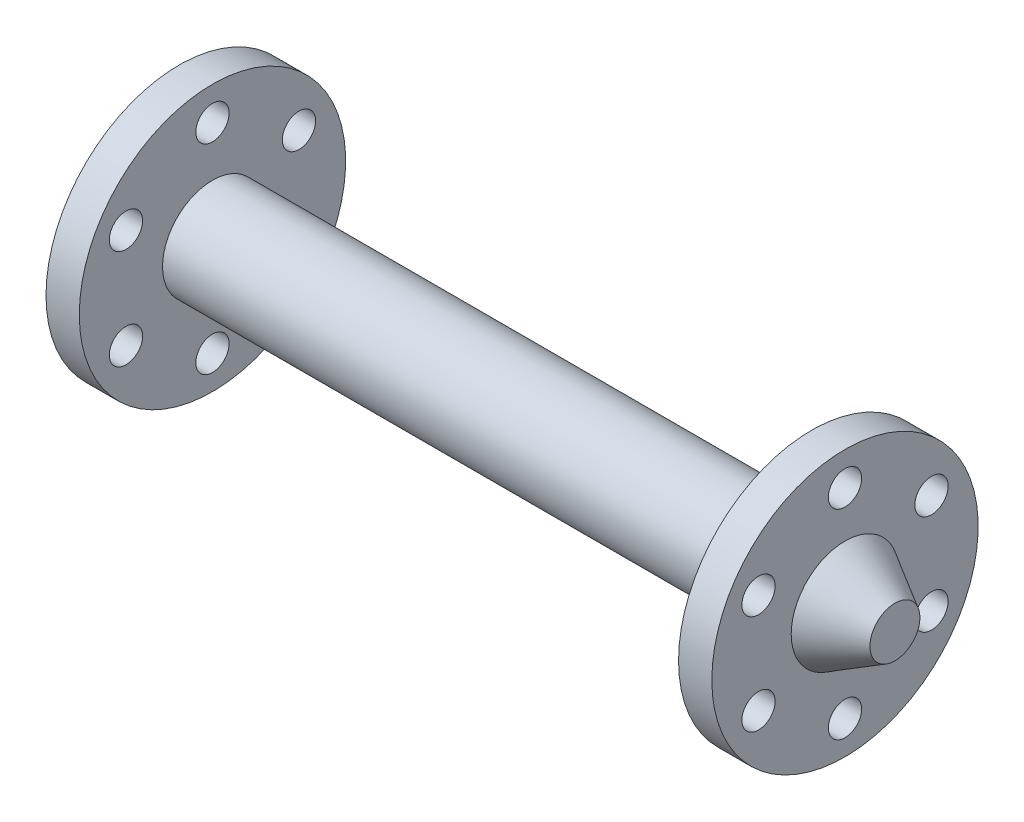
ISO-10303-21;
HEADER;
FILE_DESCRIPTION(('STEP AP214'),'2;1');
FILE_NAME('part.step','',(''),(''),'','','');
FILE_SCHEMA(('AUTOMOTIVE_DESIGN { 1 0 10303 214 1 1 1 1 }'));
ENDSEC;
DATA;
#1=APPLICATION_CONTEXT('core data for automotive mechanical design processes');
#2=APPLICATION_PROTOCOL_DEFINITION('international standard','automotive_design',2000,#1);
#3=PRODUCT_CONTEXT('',#1,'mechanical');
#4=PRODUCT('Part','Part','',(#3));
#5=PRODUCT_RELATED_PRODUCT_CATEGORY('part','',(#4));
#6=PRODUCT_DEFINITION_FORMATION('','',#4);
#7=PRODUCT_DEFINITION_CONTEXT('part definition',#1,'design');
#8=PRODUCT_DEFINITION('design','',#6,#7);
#9=PRODUCT_DEFINITION_SHAPE('','',#8);
#10=(LENGTH_UNIT() NAMED_UNIT(*) SI_UNIT(.MILLI.,.METRE.));
#11=(NAMED_UNIT(*) PLANE_ANGLE_UNIT() SI_UNIT($,.RADIAN.));
#12=(NAMED_UNIT(*) SI_UNIT($,.STERADIAN.) SOLID_ANGLE_UNIT());
#13=UNCERTAINTY_MEASURE_WITH_UNIT(LENGTH_MEASURE(1.E-05),#10,'distance_accuracy_value','');
#14=(GEOMETRIC_REPRESENTATION_CONTEXT(3) GLOBAL_UNCERTAINTY_ASSIGNED_CONTEXT((#13)) GLOBAL_UNIT_ASSIGNED_CONTEXT((#10,
#11,#12)) REPRESENTATION_CONTEXT('',''));
#15=CARTESIAN_POINT('',(0.,0.,0.));
#16=DIRECTION('',(0.,0.,1.));
#17=DIRECTION('',(1.,0.,0.));
#18=AXIS2_PLACEMENT_3D('',#15,#16,#17);
#19=CARTESIAN_POINT('',(-40.,0.,0.));
#20=DIRECTION('',(1.,0.,0.));
#21=DIRECTION('',(0.,0.,-1.));
#22=AXIS2_PLACEMENT_3D('',#19,#20,#21);
#23=PLANE('',#22);
#24=CARTESIAN_POINT('',(-39.9999999999999,0.,0.));
#25=DIRECTION('',(-1.,0.,0.));
#26=DIRECTION('',(0.,0.,1.));
#27=AXIS2_PLACEMENT_3D('',#24,#25,#26);
#28=CIRCLE('',#27,15.);
#29=CARTESIAN_POINT('',(-39.9999999999999,0.,15.));
#30=VERTEX_POINT('',#29);
#31=EDGE_CURVE('E123',#30,#30,#28,.T.);
#32=ORIENTED_EDGE('',*,*,#31,.T.);
#33=EDGE_LOOP('',(#32));
#34=FACE_BOUND('',#33,.T.);
#35=ADVANCED_FACE('F42',(#34),#23,.F.);
#36=CARTESIAN_POINT('',(420.,0.,-3.10862446895044E-12));
#37=DIRECTION('',(1.,0.,0.));
#38=DIRECTION('',(0.,0.,-1.));
#39=AXIS2_PLACEMENT_3D('',#36,#37,#38);
#40=PLANE('',#39);
#41=CARTESIAN_POINT('',(420.,0.,-1.70349845340922E-12));
#42=DIRECTION('',(-1.,0.,0.));
#43=DIRECTION('',(0.,0.,1.));
#44=AXIS2_PLACEMENT_3D('',#41,#42,#43);
#45=CIRCLE('',#44,15.);
#46=CARTESIAN_POINT('',(420.,0.,14.9999999999983));
#47=VERTEX_POINT('',#46);
#48=EDGE_CURVE('E10',#47,#47,#45,.T.);
#49=ORIENTED_EDGE('',*,*,#48,.F.);
#50=EDGE_LOOP('',(#49));
#51=FACE_BOUND('',#50,.T.);
#52=ADVANCED_FACE('F170',(#51),#40,.T.);
#53=CARTESIAN_POINT('',(420.,0.,-1.70349845340922E-12));
#54=DIRECTION('',(-1.,0.,0.));
#55=DIRECTION('',(0.,0.,1.));
#56=AXIS2_PLACEMENT_3D('',#53,#54,#55);
#57=CONICAL_SURFACE('',#56,15.,0.523598775598295);
#58=CARTESIAN_POINT('',(390.,0.,-1.59240072818688E-12));
#59=DIRECTION('',(-1.,0.,0.));
#60=DIRECTION('',(0.,0.,1.));
#61=AXIS2_PLACEMENT_3D('',#58,#59,#60);
#62=CIRCLE('',#61,32.3205080756886);
#63=CARTESIAN_POINT('',(390.,0.,32.3205080756871));
#64=VERTEX_POINT('',#63);
#65=EDGE_CURVE('E50',#64,#64,#62,.T.);
#66=ORIENTED_EDGE('',*,*,#65,.F.);
#67=EDGE_LOOP('',(#66));
#68=FACE_BOUND('',#67,.T.);
#69=ORIENTED_EDGE('',*,*,#48,.T.);
#70=EDGE_LOOP('',(#69));
#71=FACE_BOUND('',#70,.T.);
#72=ADVANCED_FACE('F158',(#68,#71),#57,.T.);
#73=CARTESIAN_POINT('',(390.,0.,-2.84147705365001E-12));
#74=DIRECTION('',(1.,0.,0.));
#75=DIRECTION('',(0.,0.,-1.));
#76=AXIS2_PLACEMENT_3D('',#73,#74,#75);
#77=PLANE('',#76);
#78=CARTESIAN_POINT('',(390.,60.,-1.44427042789043E-12));
#79=DIRECTION('',(1.,0.,0.));
#80=DIRECTION('',(0.,0.,-1.));
#81=AXIS2_PLACEMENT_3D('',#78,#79,#80);
#82=CIRCLE('',#81,10.);
#83=CARTESIAN_POINT('',(390.,60.,-10.0000000000014));
#84=VERTEX_POINT('',#83);
#85=EDGE_CURVE('E119',#84,#84,#82,.T.);
#86=ORIENTED_EDGE('',*,*,#85,.F.);
#87=EDGE_LOOP('',(#86));
#88=FACE_BOUND('',#87,.T.);
#89=CARTESIAN_POINT('',(390.,30.0000000000006,-51.9615242270674));
#90=DIRECTION('',(1.,0.,0.));
#91=DIRECTION('',(0.,0.,-1.));
#92=AXIS2_PLACEMENT_3D('',#89,#90,#91);
#93=CIRCLE('',#92,10.);
#94=CARTESIAN_POINT('',(390.,30.0000000000006,-61.9615242270674));
#95=VERTEX_POINT('',#94);
#96=EDGE_CURVE('E107',#95,#95,#93,.T.);
#97=ORIENTED_EDGE('',*,*,#96,.F.);
#98=EDGE_LOOP('',(#97));
#99=FACE_BOUND('',#98,.T.);
#100=CARTESIAN_POINT('',(390.,-29.9999999999995,-51.9615242270681));
#101=DIRECTION('',(1.,0.,0.));
#102=DIRECTION('',(0.,0.,-1.));
#103=AXIS2_PLACEMENT_3D('',#100,#101,#102);
#104=CIRCLE('',#103,9.99999999999999);
#105=CARTESIAN_POINT('',(390.,-29.9999999999995,-61.961524227068));
#106=VERTEX_POINT('',#105);
#107=EDGE_CURVE('E86',#106,#106,#104,.T.);
#108=ORIENTED_EDGE('',*,*,#107,.F.);
#109=EDGE_LOOP('',(#108));
#110=FACE_BOUND('',#109,.T.);
#111=CARTESIAN_POINT('',(390.,-60.,-1.8632481885516E-12));
#112=DIRECTION('',(1.,0.,0.));
#113=DIRECTION('',(0.,0.,-1.));
#114=AXIS2_PLACEMENT_3D('',#111,#112,#113);
#115=CIRCLE('',#114,10.);
#116=CARTESIAN_POINT('',(390.,-60.,-10.0000000000019));
#117=VERTEX_POINT('',#116);
#118=EDGE_CURVE('E81',#117,#117,#115,.T.);
#119=ORIENTED_EDGE('',*,*,#118,.F.);
#120=EDGE_LOOP('',(#119));
#121=FACE_BOUND('',#120,.T.);
#122=CARTESIAN_POINT('',(390.,-30.0000000000002,51.9615242270647));
#123=DIRECTION('',(1.,0.,0.));
#124=DIRECTION('',(0.,0.,-1.));
#125=AXIS2_PLACEMENT_3D('',#122,#123,#124);
#126=CIRCLE('',#125,10.);
#127=CARTESIAN_POINT('',(390.,-30.0000000000002,41.9615242270647));
#128=VERTEX_POINT('',#127);
#129=EDGE_CURVE('E76',#128,#128,#126,.T.);
#130=ORIENTED_EDGE('',*,*,#129,.F.);
#131=EDGE_LOOP('',(#130));
#132=FACE_BOUND('',#131,.T.);
#133=CARTESIAN_POINT('',(390.,29.9999999999999,51.9615242270649));
#134=DIRECTION('',(1.,0.,0.));
#135=DIRECTION('',(0.,0.,-1.));
#136=AXIS2_PLACEMENT_3D('',#133,#134,#135);
#137=CIRCLE('',#136,10.);
#138=CARTESIAN_POINT('',(390.,29.9999999999999,41.9615242270649));
#139=VERTEX_POINT('',#138);
#140=EDGE_CURVE('E70',#139,#139,#137,.T.);
#141=ORIENTED_EDGE('',*,*,#140,.F.);
#142=EDGE_LOOP('',(#141));
#143=FACE_BOUND('',#142,.T.);
#144=ORIENTED_EDGE('',*,*,#65,.T.);
#145=EDGE_LOOP('',(#144));
#146=FACE_BOUND('',#145,.T.);
#147=CARTESIAN_POINT('',(390.,0.,-1.59240072818688E-12));
#148=DIRECTION('',(-1.,0.,0.));
#149=DIRECTION('',(0.,0.,1.));
#150=AXIS2_PLACEMENT_3D('',#147,#148,#149);
#151=CIRCLE('',#150,79.9999999999999);
#152=CARTESIAN_POINT('',(390.,0.,79.9999999999983));
#153=VERTEX_POINT('',#152);
#154=EDGE_CURVE('E56',#153,#153,#151,.T.);
#155=ORIENTED_EDGE('',*,*,#154,.F.);
#156=EDGE_LOOP('',(#155));
#157=FACE_BOUND('',#156,.T.);
#158=ADVANCED_FACE('F156',(#88,#99,#110,#121,#132,#143,#146,#157),#77,.T.);
#159=CARTESIAN_POINT('',(-40.,0.,0.));
#160=DIRECTION('',(-1.,0.,0.));
#161=DIRECTION('',(0.,0.,1.));
#162=AXIS2_PLACEMENT_3D('',#159,#160,#161);
#163=CYLINDRICAL_SURFACE('',#162,79.9999999999998);
#164=CARTESIAN_POINT('',(370.,0.,-1.51833557803866E-12));
#165=DIRECTION('',(-1.,0.,0.));
#166=DIRECTION('',(0.,0.,1.));
#167=AXIS2_PLACEMENT_3D('',#164,#165,#166);
#168=CIRCLE('',#167,79.9999999999998);
#169=CARTESIAN_POINT('',(370.,0.,79.9999999999983));
#170=VERTEX_POINT('',#169);
#171=EDGE_CURVE('E147',#170,#170,#168,.T.);
#172=ORIENTED_EDGE('',*,*,#171,.F.);
#173=EDGE_LOOP('',(#172));
#174=FACE_BOUND('',#173,.T.);
#175=ORIENTED_EDGE('',*,*,#154,.T.);
#176=EDGE_LOOP('',(#175));
#177=FACE_BOUND('',#176,.T.);
#178=ADVANCED_FACE('F154',(#174,#177),#163,.T.);
#179=CARTESIAN_POINT('',(370.,0.,0.));
#180=DIRECTION('',(1.,0.,0.));
#181=DIRECTION('',(0.,0.,-1.));
#182=AXIS2_PLACEMENT_3D('',#179,#180,#181);
#183=PLANE('',#182);
#184=CARTESIAN_POINT('',(370.,60.,-1.3702052777422E-12));
#185=DIRECTION('',(1.,0.,0.));
#186=DIRECTION('',(0.,0.,-1.));
#187=AXIS2_PLACEMENT_3D('',#184,#185,#186);
#188=CIRCLE('',#187,10.);
#189=CARTESIAN_POINT('',(370.,60.,-10.0000000000014));
#190=VERTEX_POINT('',#189);
#191=EDGE_CURVE('E115',#190,#190,#188,.T.);
#192=ORIENTED_EDGE('',*,*,#191,.T.);
#193=EDGE_LOOP('',(#192));
#194=FACE_BOUND('',#193,.T.);
#195=CARTESIAN_POINT('',(370.,30.0000000000006,-51.9615242270673));
#196=DIRECTION('',(1.,0.,0.));
#197=DIRECTION('',(0.,0.,-1.));
#198=AXIS2_PLACEMENT_3D('',#195,#196,#197);
#199=CIRCLE('',#198,10.);
#200=CARTESIAN_POINT('',(370.,30.0000000000006,-61.9615242270673));
#201=VERTEX_POINT('',#200);
#202=EDGE_CURVE('E92',#201,#201,#199,.T.);
#203=ORIENTED_EDGE('',*,*,#202,.T.);
#204=EDGE_LOOP('',(#203));
#205=FACE_BOUND('',#204,.T.);
#206=CARTESIAN_POINT('',(370.,-29.9999999999995,-51.961524227068));
#207=DIRECTION('',(1.,0.,0.));
#208=DIRECTION('',(0.,0.,-1.));
#209=AXIS2_PLACEMENT_3D('',#206,#207,#208);
#210=CIRCLE('',#209,9.99999999999999);
#211=CARTESIAN_POINT('',(370.,-29.9999999999995,-61.961524227068));
#212=VERTEX_POINT('',#211);
#213=EDGE_CURVE('E95',#212,#212,#210,.T.);
#214=ORIENTED_EDGE('',*,*,#213,.T.);
#215=EDGE_LOOP('',(#214));
#216=FACE_BOUND('',#215,.T.);
#217=CARTESIAN_POINT('',(370.,-60.,-1.78918303840338E-12));
#218=DIRECTION('',(1.,0.,0.));
#219=DIRECTION('',(0.,0.,-1.));
#220=AXIS2_PLACEMENT_3D('',#217,#218,#219);
#221=CIRCLE('',#220,10.);
#222=CARTESIAN_POINT('',(370.,-60.,-10.0000000000018));
#223=VERTEX_POINT('',#222);
#224=EDGE_CURVE('E227',#223,#223,#221,.T.);
#225=ORIENTED_EDGE('',*,*,#224,.T.);
#226=EDGE_LOOP('',(#225));
#227=FACE_BOUND('',#226,.T.);
#228=CARTESIAN_POINT('',(370.,-30.0000000000002,51.9615242270648));
#229=DIRECTION('',(1.,0.,0.));
#230=DIRECTION('',(0.,0.,-1.));
#231=AXIS2_PLACEMENT_3D('',#228,#229,#230);
#232=CIRCLE('',#231,10.);
#233=CARTESIAN_POINT('',(370.,-30.0000000000002,41.9615242270648));
#234=VERTEX_POINT('',#233);
#235=EDGE_CURVE('E231',#234,#234,#232,.T.);
#236=ORIENTED_EDGE('',*,*,#235,.T.);
#237=EDGE_LOOP('',(#236));
#238=FACE_BOUND('',#237,.T.);
#239=CARTESIAN_POINT('',(370.,29.9999999999999,51.961524227065));
#240=DIRECTION('',(1.,0.,0.));
#241=DIRECTION('',(0.,0.,-1.));
#242=AXIS2_PLACEMENT_3D('',#239,#240,#241);
#243=CIRCLE('',#242,10.);
#244=CARTESIAN_POINT('',(370.,29.9999999999999,41.961524227065));
#245=VERTEX_POINT('',#244);
#246=EDGE_CURVE('E235',#245,#245,#243,.T.);
#247=ORIENTED_EDGE('',*,*,#246,.T.);
#248=EDGE_LOOP('',(#247));
#249=FACE_BOUND('',#248,.T.);
#250=CARTESIAN_POINT('',(370.,0.,-1.51833557803866E-12));
#251=DIRECTION('',(-1.,0.,0.));
#252=DIRECTION('',(0.,0.,1.));
#253=AXIS2_PLACEMENT_3D('',#250,#251,#252);
#254=CIRCLE('',#253,29.9999999999985);
#255=CARTESIAN_POINT('',(370.,0.,29.999999999997));
#256=VERTEX_POINT('',#255);
#257=EDGE_CURVE('E143',#256,#256,#254,.T.);
#258=ORIENTED_EDGE('',*,*,#257,.F.);
#259=EDGE_LOOP('',(#258));
#260=FACE_BOUND('',#259,.T.);
#261=ORIENTED_EDGE('',*,*,#171,.T.);
#262=EDGE_LOOP('',(#261));
#263=FACE_BOUND('',#262,.T.);
#264=ADVANCED_FACE('F166',(#194,#205,#216,#227,#238,#249,#260,#263),#183,.F.);
#265=CARTESIAN_POINT('',(-40.,0.,0.));
#266=DIRECTION('',(-1.,0.,0.));
#267=DIRECTION('',(0.,0.,1.));
#268=AXIS2_PLACEMENT_3D('',#265,#266,#267);
#269=CYLINDRICAL_SURFACE('',#268,29.9999999999991);
#270=ORIENTED_EDGE('',*,*,#257,.T.);
#271=EDGE_LOOP('',(#270));
#272=FACE_BOUND('',#271,.T.);
#273=CARTESIAN_POINT('',(10.0000000000001,0.,-1.85162875370568E-13));
#274=DIRECTION('',(-1.,0.,0.));
#275=DIRECTION('',(0.,0.,1.));
#276=AXIS2_PLACEMENT_3D('',#273,#274,#275);
#277=CIRCLE('',#276,29.9999999999998);
#278=CARTESIAN_POINT('',(10.0000000000002,0.,29.9999999999996));
#279=VERTEX_POINT('',#278);
#280=EDGE_CURVE('E139',#279,#279,#277,.T.);
#281=ORIENTED_EDGE('',*,*,#280,.F.);
#282=EDGE_LOOP('',(#281));
#283=FACE_BOUND('',#282,.T.);
#284=ADVANCED_FACE('F210',(#272,#283),#269,.T.);
#285=CARTESIAN_POINT('',(10.0000000000002,0.,0.));
#286=DIRECTION('',(1.,0.,0.));
#287=DIRECTION('',(0.,0.,-1.));
#288=AXIS2_PLACEMENT_3D('',#285,#286,#287);
#289=PLANE('',#288);
#290=CARTESIAN_POINT('',(10.0000000000002,60.,0.));
#291=DIRECTION('',(1.,0.,0.));
#292=DIRECTION('',(0.,0.,-1.));
#293=AXIS2_PLACEMENT_3D('',#290,#291,#292);
#294=CIRCLE('',#293,10.);
#295=CARTESIAN_POINT('',(10.0000000000001,60.,-10.));
#296=VERTEX_POINT('',#295);
#297=EDGE_CURVE('E111',#296,#296,#294,.T.);
#298=ORIENTED_EDGE('',*,*,#297,.F.);
#299=EDGE_LOOP('',(#298));
#300=FACE_BOUND('',#299,.T.);
#301=CARTESIAN_POINT('',(10.,30.0000000000006,-51.961524227066));
#302=DIRECTION('',(1.,0.,0.));
#303=DIRECTION('',(0.,0.,-1.));
#304=AXIS2_PLACEMENT_3D('',#301,#302,#303);
#305=CIRCLE('',#304,10.);
#306=CARTESIAN_POINT('',(9.99999999999997,30.0000000000006,-61.961524227066));
#307=VERTEX_POINT('',#306);
#308=EDGE_CURVE('E85',#307,#307,#305,.T.);
#309=ORIENTED_EDGE('',*,*,#308,.F.);
#310=EDGE_LOOP('',(#309));
#311=FACE_BOUND('',#310,.T.);
#312=CARTESIAN_POINT('',(10.,-29.9999999999995,-51.9615242270666));
#313=DIRECTION('',(1.,0.,0.));
#314=DIRECTION('',(0.,0.,-1.));
#315=AXIS2_PLACEMENT_3D('',#312,#313,#314);
#316=CIRCLE('',#315,9.99999999999999);
#317=CARTESIAN_POINT('',(9.99999999999997,-29.9999999999995,-61.9615242270666));
#318=VERTEX_POINT('',#317);
#319=EDGE_CURVE('E80',#318,#318,#316,.T.);
#320=ORIENTED_EDGE('',*,*,#319,.F.);
#321=EDGE_LOOP('',(#320));
#322=FACE_BOUND('',#321,.T.);
#323=CARTESIAN_POINT('',(10.0000000000002,-60.,-4.5601033573529E-13));
#324=DIRECTION('',(1.,0.,0.));
#325=DIRECTION('',(0.,0.,-1.));
#326=AXIS2_PLACEMENT_3D('',#323,#324,#325);
#327=CIRCLE('',#326,10.);
#328=CARTESIAN_POINT('',(10.0000000000001,-60.,-10.0000000000005));
#329=VERTEX_POINT('',#328);
#330=EDGE_CURVE('E75',#329,#329,#327,.T.);
#331=ORIENTED_EDGE('',*,*,#330,.F.);
#332=EDGE_LOOP('',(#331));
#333=FACE_BOUND('',#332,.T.);
#334=CARTESIAN_POINT('',(10.0000000000003,-30.0000000000002,51.9615242270661));
#335=DIRECTION('',(1.,0.,0.));
#336=DIRECTION('',(0.,0.,-1.));
#337=AXIS2_PLACEMENT_3D('',#334,#335,#336);
#338=CIRCLE('',#337,10.);
#339=CARTESIAN_POINT('',(10.0000000000003,-30.0000000000002,41.9615242270662));
#340=VERTEX_POINT('',#339);
#341=EDGE_CURVE('E69',#340,#340,#338,.T.);
#342=ORIENTED_EDGE('',*,*,#341,.F.);
#343=EDGE_LOOP('',(#342));
#344=FACE_BOUND('',#343,.T.);
#345=CARTESIAN_POINT('',(10.0000000000003,29.9999999999999,51.9615242270664));
#346=DIRECTION('',(1.,0.,0.));
#347=DIRECTION('',(0.,0.,-1.));
#348=AXIS2_PLACEMENT_3D('',#345,#346,#347);
#349=CIRCLE('',#348,10.);
#350=CARTESIAN_POINT('',(10.0000000000003,29.9999999999999,41.9615242270663));
#351=VERTEX_POINT('',#350);
#352=EDGE_CURVE('E64',#351,#351,#349,.T.);
#353=ORIENTED_EDGE('',*,*,#352,.F.);
#354=EDGE_LOOP('',(#353));
#355=FACE_BOUND('',#354,.T.);
#356=ORIENTED_EDGE('',*,*,#280,.T.);
#357=EDGE_LOOP('',(#356));
#358=FACE_BOUND('',#357,.T.);
#359=CARTESIAN_POINT('',(10.0000000000003,0.,-1.85162875370569E-13));
#360=DIRECTION('',(-1.,0.,0.));
#361=DIRECTION('',(0.,0.,1.));
#362=AXIS2_PLACEMENT_3D('',#359,#360,#361);
#363=CIRCLE('',#362,79.9999999999998);
#364=CARTESIAN_POINT('',(10.0000000000006,0.,79.9999999999996));
#365=VERTEX_POINT('',#364);
#366=EDGE_CURVE('E135',#365,#365,#363,.T.);
#367=ORIENTED_EDGE('',*,*,#366,.F.);
#368=EDGE_LOOP('',(#367));
#369=FACE_BOUND('',#368,.T.);
#370=ADVANCED_FACE('F206',(#300,#311,#322,#333,#344,#355,#358,#369),#289,.T.);
#371=CARTESIAN_POINT('',(-40.,0.,0.));
#372=DIRECTION('',(-1.,0.,0.));
#373=DIRECTION('',(0.,0.,1.));
#374=AXIS2_PLACEMENT_3D('',#371,#372,#373);
#375=CYLINDRICAL_SURFACE('',#374,79.9999999999998);
#376=ORIENTED_EDGE('',*,*,#366,.T.);
#377=EDGE_LOOP('',(#376));
#378=FACE_BOUND('',#377,.T.);
#379=CARTESIAN_POINT('',(-9.99999999999971,0.,-1.11097725222342E-13));
#380=DIRECTION('',(-1.,0.,0.));
#381=DIRECTION('',(0.,0.,1.));
#382=AXIS2_PLACEMENT_3D('',#379,#380,#381);
#383=CIRCLE('',#382,79.9999999999999);
#384=CARTESIAN_POINT('',(-9.99999999999941,0.,79.9999999999998));
#385=VERTEX_POINT('',#384);
#386=EDGE_CURVE('E131',#385,#385,#383,.T.);
#387=ORIENTED_EDGE('',*,*,#386,.F.);
#388=EDGE_LOOP('',(#387));
#389=FACE_BOUND('',#388,.T.);
#390=ADVANCED_FACE('F197',(#378,#389),#375,.T.);
#391=CARTESIAN_POINT('',(-9.9999999999998,0.,0.));
#392=DIRECTION('',(1.,0.,0.));
#393=DIRECTION('',(0.,0.,-1.));
#394=AXIS2_PLACEMENT_3D('',#391,#392,#393);
#395=PLANE('',#394);
#396=CARTESIAN_POINT('',(-9.99999999999979,60.,0.));
#397=DIRECTION('',(1.,0.,0.));
#398=DIRECTION('',(0.,0.,-1.));
#399=AXIS2_PLACEMENT_3D('',#396,#397,#398);
#400=CIRCLE('',#399,10.);
#401=CARTESIAN_POINT('',(-9.99999999999982,60.,-9.99999999999996));
#402=VERTEX_POINT('',#401);
#403=EDGE_CURVE('E45',#402,#402,#400,.T.);
#404=ORIENTED_EDGE('',*,*,#403,.T.);
#405=EDGE_LOOP('',(#404));
#406=FACE_BOUND('',#405,.T.);
#407=CARTESIAN_POINT('',(-9.99999999999995,30.0000000000006,-51.9615242270659));
#408=DIRECTION('',(1.,0.,0.));
#409=DIRECTION('',(0.,0.,-1.));
#410=AXIS2_PLACEMENT_3D('',#407,#408,#409);
#411=CIRCLE('',#410,10.);
#412=CARTESIAN_POINT('',(-9.99999999999999,30.0000000000006,-61.9615242270659));
#413=VERTEX_POINT('',#412);
#414=EDGE_CURVE('E82',#413,#413,#411,.T.);
#415=ORIENTED_EDGE('',*,*,#414,.T.);
#416=EDGE_LOOP('',(#415));
#417=FACE_BOUND('',#416,.T.);
#418=CARTESIAN_POINT('',(-9.99999999999995,-29.9999999999995,-51.9615242270666));
#419=DIRECTION('',(1.,0.,0.));
#420=DIRECTION('',(0.,0.,-1.));
#421=AXIS2_PLACEMENT_3D('',#418,#419,#420);
#422=CIRCLE('',#421,9.99999999999999);
#423=CARTESIAN_POINT('',(-9.99999999999999,-29.9999999999995,-61.9615242270666));
#424=VERTEX_POINT('',#423);
#425=EDGE_CURVE('E77',#424,#424,#422,.T.);
#426=ORIENTED_EDGE('',*,*,#425,.T.);
#427=EDGE_LOOP('',(#426));
#428=FACE_BOUND('',#427,.T.);
#429=CARTESIAN_POINT('',(-9.99999999999979,-60.,-3.81945185587063E-13));
#430=DIRECTION('',(1.,0.,0.));
#431=DIRECTION('',(0.,0.,-1.));
#432=AXIS2_PLACEMENT_3D('',#429,#430,#431);
#433=CIRCLE('',#432,10.);
#434=CARTESIAN_POINT('',(-9.99999999999982,-60.,-10.0000000000004));
#435=VERTEX_POINT('',#434);
#436=EDGE_CURVE('E71',#435,#435,#433,.T.);
#437=ORIENTED_EDGE('',*,*,#436,.T.);
#438=EDGE_LOOP('',(#437));
#439=FACE_BOUND('',#438,.T.);
#440=CARTESIAN_POINT('',(-9.99999999999962,-30.0000000000002,51.9615242270662));
#441=DIRECTION('',(1.,0.,0.));
#442=DIRECTION('',(0.,0.,-1.));
#443=AXIS2_PLACEMENT_3D('',#440,#441,#442);
#444=CIRCLE('',#443,10.);
#445=CARTESIAN_POINT('',(-9.99999999999966,-30.0000000000002,41.9615242270662));
#446=VERTEX_POINT('',#445);
#447=EDGE_CURVE('E65',#446,#446,#444,.T.);
#448=ORIENTED_EDGE('',*,*,#447,.T.);
#449=EDGE_LOOP('',(#448));
#450=FACE_BOUND('',#449,.T.);
#451=CARTESIAN_POINT('',(-9.99999999999962,29.9999999999999,51.9615242270664));
#452=DIRECTION('',(1.,0.,0.));
#453=DIRECTION('',(0.,0.,-1.));
#454=AXIS2_PLACEMENT_3D('',#451,#452,#453);
#455=CIRCLE('',#454,10.);
#456=CARTESIAN_POINT('',(-9.99999999999966,29.9999999999999,41.9615242270664));
#457=VERTEX_POINT('',#456);
#458=EDGE_CURVE('E60',#457,#457,#455,.T.);
#459=ORIENTED_EDGE('',*,*,#458,.T.);
#460=EDGE_LOOP('',(#459));
#461=FACE_BOUND('',#460,.T.);
#462=CARTESIAN_POINT('',(-9.99999999999988,0.,-1.11097725222341E-13));
#463=DIRECTION('',(-1.,0.,0.));
#464=DIRECTION('',(0.,0.,1.));
#465=AXIS2_PLACEMENT_3D('',#462,#463,#464);
#466=CIRCLE('',#465,32.3205080756887);
#467=CARTESIAN_POINT('',(-9.99999999999976,0.,32.3205080756886));
#468=VERTEX_POINT('',#467);
#469=EDGE_CURVE('E127',#468,#468,#466,.T.);
#470=ORIENTED_EDGE('',*,*,#469,.F.);
#471=EDGE_LOOP('',(#470));
#472=FACE_BOUND('',#471,.T.);
#473=ORIENTED_EDGE('',*,*,#386,.T.);
#474=EDGE_LOOP('',(#473));
#475=FACE_BOUND('',#474,.T.);
#476=ADVANCED_FACE('F186',(#406,#417,#428,#439,#450,#461,#472,#475),#395,.F.);
#477=CARTESIAN_POINT('',(-39.9999999999999,0.,0.));
#478=DIRECTION('',(1.,0.,0.));
#479=DIRECTION('',(0.,0.,-1.));
#480=AXIS2_PLACEMENT_3D('',#477,#478,#479);
#481=CONICAL_SURFACE('',#480,15.,0.523598775598296);
#482=ORIENTED_EDGE('',*,*,#469,.T.);
#483=EDGE_LOOP('',(#482));
#484=FACE_BOUND('',#483,.T.);
#485=ORIENTED_EDGE('',*,*,#31,.F.);
#486=EDGE_LOOP('',(#485));
#487=FACE_BOUND('',#486,.T.);
#488=ADVANCED_FACE('F183',(#484,#487),#481,.T.);
#489=CARTESIAN_POINT('',(420.000000000001,29.9999999999999,51.9615242270648));
#490=DIRECTION('',(-1.,0.,0.));
#491=DIRECTION('',(0.,0.,1.));
#492=AXIS2_PLACEMENT_3D('',#489,#490,#491);
#493=CYLINDRICAL_SURFACE('',#492,10.);
#494=ORIENTED_EDGE('',*,*,#352,.T.);
#495=EDGE_LOOP('',(#494));
#496=FACE_BOUND('',#495,.T.);
#497=ORIENTED_EDGE('',*,*,#458,.F.);
#498=EDGE_LOOP('',(#497));
#499=FACE_BOUND('',#498,.T.);
#500=ADVANCED_FACE('F185',(#496,#499),#493,.F.);
#501=CARTESIAN_POINT('',(420.000000000001,-30.0000000000002,51.9615242270646));
#502=DIRECTION('',(-1.,0.,0.));
#503=DIRECTION('',(0.,0.,1.));
#504=AXIS2_PLACEMENT_3D('',#501,#502,#503);
#505=CYLINDRICAL_SURFACE('',#504,10.);
#506=ORIENTED_EDGE('',*,*,#341,.T.);
#507=EDGE_LOOP('',(#506));
#508=FACE_BOUND('',#507,.T.);
#509=ORIENTED_EDGE('',*,*,#447,.F.);
#510=EDGE_LOOP('',(#509));
#511=FACE_BOUND('',#510,.T.);
#512=ADVANCED_FACE('F192',(#508,#511),#505,.F.);
#513=CARTESIAN_POINT('',(420.,-60.,-1.97434591377395E-12));
#514=DIRECTION('',(-1.,0.,0.));
#515=DIRECTION('',(0.,0.,1.));
#516=AXIS2_PLACEMENT_3D('',#513,#514,#515);
#517=CYLINDRICAL_SURFACE('',#516,10.);
#518=ORIENTED_EDGE('',*,*,#330,.T.);
#519=EDGE_LOOP('',(#518));
#520=FACE_BOUND('',#519,.T.);
#521=ORIENTED_EDGE('',*,*,#436,.F.);
#522=EDGE_LOOP('',(#521));
#523=FACE_BOUND('',#522,.T.);
#524=ADVANCED_FACE('F293',(#520,#523),#517,.F.);
#525=CARTESIAN_POINT('',(420.,-29.9999999999995,-51.9615242270682));
#526=DIRECTION('',(-1.,0.,0.));
#527=DIRECTION('',(0.,0.,1.));
#528=AXIS2_PLACEMENT_3D('',#525,#526,#527);
#529=CYLINDRICAL_SURFACE('',#528,9.99999999999999);
#530=ORIENTED_EDGE('',*,*,#319,.T.);
#531=EDGE_LOOP('',(#530));
#532=FACE_BOUND('',#531,.T.);
#533=ORIENTED_EDGE('',*,*,#425,.F.);
#534=EDGE_LOOP('',(#533));
#535=FACE_BOUND('',#534,.T.);
#536=ADVANCED_FACE('F276',(#532,#535),#529,.F.);
#537=CARTESIAN_POINT('',(420.,30.0000000000006,-51.9615242270675));
#538=DIRECTION('',(-1.,0.,0.));
#539=DIRECTION('',(0.,0.,1.));
#540=AXIS2_PLACEMENT_3D('',#537,#538,#539);
#541=CYLINDRICAL_SURFACE('',#540,10.);
#542=ORIENTED_EDGE('',*,*,#308,.T.);
#543=EDGE_LOOP('',(#542));
#544=FACE_BOUND('',#543,.T.);
#545=ORIENTED_EDGE('',*,*,#414,.F.);
#546=EDGE_LOOP('',(#545));
#547=FACE_BOUND('',#546,.T.);
#548=ADVANCED_FACE('F322',(#544,#547),#541,.F.);
#549=CARTESIAN_POINT('',(420.,60.,-1.55536815311277E-12));
#550=DIRECTION('',(-1.,0.,0.));
#551=DIRECTION('',(0.,0.,1.));
#552=AXIS2_PLACEMENT_3D('',#549,#550,#551);
#553=CYLINDRICAL_SURFACE('',#552,10.);
#554=ORIENTED_EDGE('',*,*,#297,.T.);
#555=EDGE_LOOP('',(#554));
#556=FACE_BOUND('',#555,.T.);
#557=ORIENTED_EDGE('',*,*,#403,.F.);
#558=EDGE_LOOP('',(#557));
#559=FACE_BOUND('',#558,.T.);
#560=ADVANCED_FACE('F310',(#556,#559),#553,.F.);
#561=ORIENTED_EDGE('',*,*,#140,.T.);
#562=EDGE_LOOP('',(#561));
#563=FACE_BOUND('',#562,.T.);
#564=ORIENTED_EDGE('',*,*,#246,.F.);
#565=EDGE_LOOP('',(#564));
#566=FACE_BOUND('',#565,.T.);
#567=ADVANCED_FACE('F195',(#563,#566),#493,.F.);
#568=ORIENTED_EDGE('',*,*,#129,.T.);
#569=EDGE_LOOP('',(#568));
#570=FACE_BOUND('',#569,.T.);
#571=ORIENTED_EDGE('',*,*,#235,.F.);
#572=EDGE_LOOP('',(#571));
#573=FACE_BOUND('',#572,.T.);
#574=ADVANCED_FACE('F295',(#570,#573),#505,.F.);
#575=ORIENTED_EDGE('',*,*,#118,.T.);
#576=EDGE_LOOP('',(#575));
#577=FACE_BOUND('',#576,.T.);
#578=ORIENTED_EDGE('',*,*,#224,.F.);
#579=EDGE_LOOP('',(#578));
#580=FACE_BOUND('',#579,.T.);
#581=ADVANCED_FACE('F302',(#577,#580),#517,.F.);
#582=ORIENTED_EDGE('',*,*,#107,.T.);
#583=EDGE_LOOP('',(#582));
#584=FACE_BOUND('',#583,.T.);
#585=ORIENTED_EDGE('',*,*,#213,.F.);
#586=EDGE_LOOP('',(#585));
#587=FACE_BOUND('',#586,.T.);
#588=ADVANCED_FACE('F201',(#584,#587),#529,.F.);
#589=ORIENTED_EDGE('',*,*,#96,.T.);
#590=EDGE_LOOP('',(#589));
#591=FACE_BOUND('',#590,.T.);
#592=ORIENTED_EDGE('',*,*,#202,.F.);
#593=EDGE_LOOP('',(#592));
#594=FACE_BOUND('',#593,.T.);
#595=ADVANCED_FACE('F327',(#591,#594),#541,.F.);
#596=ORIENTED_EDGE('',*,*,#85,.T.);
#597=EDGE_LOOP('',(#596));
#598=FACE_BOUND('',#597,.T.);
#599=ORIENTED_EDGE('',*,*,#191,.F.);
#600=EDGE_LOOP('',(#599));
#601=FACE_BOUND('',#600,.T.);
#602=ADVANCED_FACE('F325',(#598,#601),#553,.F.);
#603=CLOSED_SHELL('',(#35,#52,#72,#158,#178,#264,#284,#370,#390,#476,#488,#500,#512,#524,#536,
#548,#560,#567,#574,#581,#588,#595,#602));
#604=MANIFOLD_SOLID_BREP('B2',#603);
#605=ADVANCED_BREP_SHAPE_REPRESENTATION('',(#18,#604),#14);
#606=SHAPE_DEFINITION_REPRESENTATION(#9,#605);
ENDSEC;
END-ISO-10303-21;
